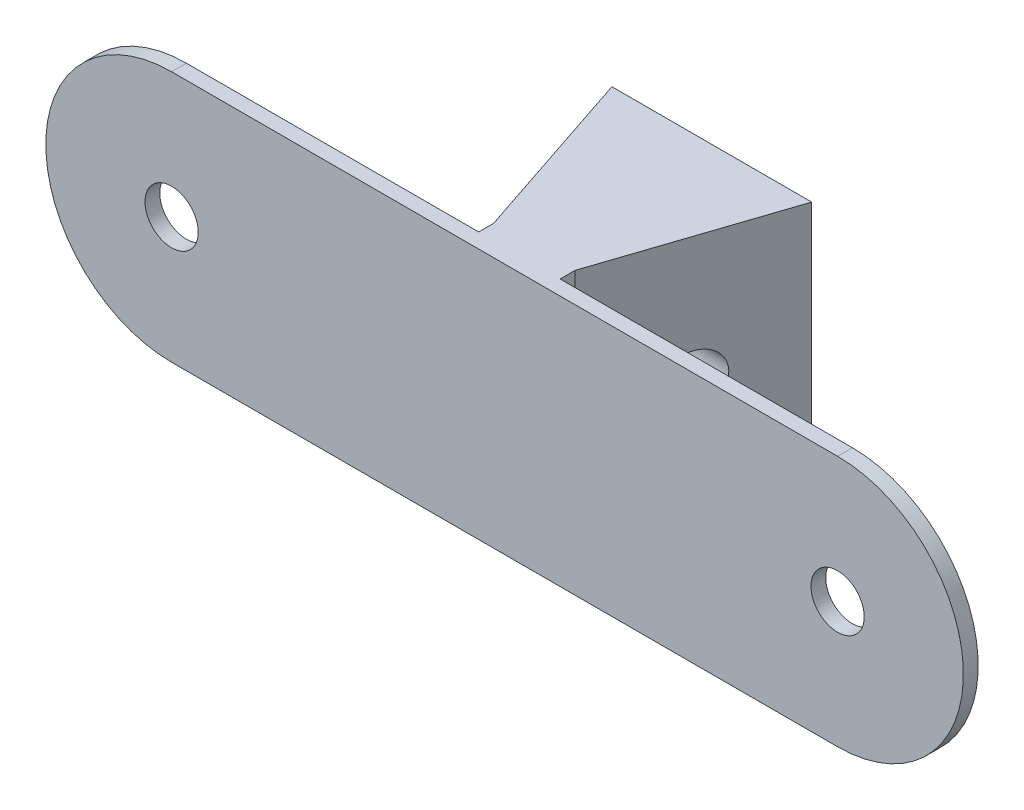
ISO-10303-21;
HEADER;
FILE_DESCRIPTION(('STEP AP214'),'2;1');
FILE_NAME('part.step','',(''),(''),'','','');
FILE_SCHEMA(('AUTOMOTIVE_DESIGN { 1 0 10303 214 1 1 1 1 }'));
ENDSEC;
DATA;
#1=APPLICATION_CONTEXT('core data for automotive mechanical design processes');
#2=APPLICATION_PROTOCOL_DEFINITION('international standard','automotive_design',2000,#1);
#3=PRODUCT_CONTEXT('',#1,'mechanical');
#4=PRODUCT('Part','Part','',(#3));
#5=PRODUCT_RELATED_PRODUCT_CATEGORY('part','',(#4));
#6=PRODUCT_DEFINITION_FORMATION('','',#4);
#7=PRODUCT_DEFINITION_CONTEXT('part definition',#1,'design');
#8=PRODUCT_DEFINITION('design','',#6,#7);
#9=PRODUCT_DEFINITION_SHAPE('','',#8);
#10=(LENGTH_UNIT() NAMED_UNIT(*) SI_UNIT(.MILLI.,.METRE.));
#11=(NAMED_UNIT(*) PLANE_ANGLE_UNIT() SI_UNIT($,.RADIAN.));
#12=(NAMED_UNIT(*) SI_UNIT($,.STERADIAN.) SOLID_ANGLE_UNIT());
#13=UNCERTAINTY_MEASURE_WITH_UNIT(LENGTH_MEASURE(1.E-05),#10,'distance_accuracy_value','');
#14=(GEOMETRIC_REPRESENTATION_CONTEXT(3) GLOBAL_UNCERTAINTY_ASSIGNED_CONTEXT((#13)) GLOBAL_UNIT_ASSIGNED_CONTEXT((#10,
#11,#12)) REPRESENTATION_CONTEXT('',''));
#15=CARTESIAN_POINT('',(0.,0.,0.));
#16=DIRECTION('',(0.,0.,1.));
#17=DIRECTION('',(1.,0.,0.));
#18=AXIS2_PLACEMENT_3D('',#15,#16,#17);
#19=CARTESIAN_POINT('',(0.,0.,0.));
#20=DIRECTION('',(0.,0.,1.));
#21=DIRECTION('',(1.,0.,0.));
#22=AXIS2_PLACEMENT_3D('',#19,#20,#21);
#23=PLANE('',#22);
#24=CARTESIAN_POINT('',(45.,0.,0.));
#25=DIRECTION('',(0.,0.,1.));
#26=DIRECTION('',(1.,0.,0.));
#27=AXIS2_PLACEMENT_3D('',#24,#25,#26);
#28=CIRCLE('',#27,1.8);
#29=CARTESIAN_POINT('',(46.8,0.,0.));
#30=VERTEX_POINT('',#29);
#31=EDGE_CURVE('E209',#30,#30,#28,.T.);
#32=ORIENTED_EDGE('',*,*,#31,.T.);
#33=EDGE_LOOP('',(#32));
#34=FACE_BOUND('',#33,.T.);
#35=CARTESIAN_POINT('',(0.,0.,0.));
#36=DIRECTION('',(0.,0.,1.));
#37=DIRECTION('',(1.,0.,0.));
#38=AXIS2_PLACEMENT_3D('',#35,#36,#37);
#39=CIRCLE('',#38,1.79999999999999);
#40=CARTESIAN_POINT('',(1.79999999999999,0.,0.));
#41=VERTEX_POINT('',#40);
#42=EDGE_CURVE('E201',#41,#41,#39,.T.);
#43=ORIENTED_EDGE('',*,*,#42,.T.);
#44=EDGE_LOOP('',(#43));
#45=FACE_BOUND('',#44,.T.);
#46=DIRECTION('',(0.,1.,0.));
#47=VECTOR('',#46,1.);
#48=CARTESIAN_POINT('',(19.75,-6.99999999999999,0.));
#49=LINE('',#48,#47);
#50=CARTESIAN_POINT('',(19.75,-6.99999999999999,0.));
#51=VERTEX_POINT('',#50);
#52=CARTESIAN_POINT('',(19.75,8.50000000000001,0.));
#53=VERTEX_POINT('',#52);
#54=EDGE_CURVE('E149',#51,#53,#49,.T.);
#55=ORIENTED_EDGE('',*,*,#54,.F.);
#56=DIRECTION('',(1.,0.,0.));
#57=VECTOR('',#56,1.);
#58=CARTESIAN_POINT('',(25.25,-6.99999999999999,0.));
#59=LINE('',#58,#57);
#60=CARTESIAN_POINT('',(25.25,-6.99999999999999,0.));
#61=VERTEX_POINT('',#60);
#62=EDGE_CURVE('E141',#51,#61,#59,.T.);
#63=ORIENTED_EDGE('',*,*,#62,.T.);
#64=DIRECTION('',(0.,1.,0.));
#65=VECTOR('',#64,1.);
#66=CARTESIAN_POINT('',(25.25,-6.99999999999999,0.));
#67=LINE('',#66,#65);
#68=CARTESIAN_POINT('',(25.25,8.50000000000001,0.));
#69=VERTEX_POINT('',#68);
#70=EDGE_CURVE('E125',#61,#69,#67,.T.);
#71=ORIENTED_EDGE('',*,*,#70,.T.);
#72=DIRECTION('',(-1.,0.,0.));
#73=VECTOR('',#72,1.);
#74=CARTESIAN_POINT('',(0.,8.50000000000001,0.));
#75=LINE('',#74,#73);
#76=CARTESIAN_POINT('',(45.,8.50000000000001,0.));
#77=VERTEX_POINT('',#76);
#78=EDGE_CURVE('E217',#77,#69,#75,.T.);
#79=ORIENTED_EDGE('',*,*,#78,.F.);
#80=CARTESIAN_POINT('',(44.9999999999999,0.,0.));
#81=DIRECTION('',(0.,0.,1.));
#82=DIRECTION('',(1.,0.,0.));
#83=AXIS2_PLACEMENT_3D('',#80,#81,#82);
#84=CIRCLE('',#83,8.50000000000001);
#85=CARTESIAN_POINT('',(45.,-8.50000000000001,0.));
#86=VERTEX_POINT('',#85);
#87=EDGE_CURVE('E232',#86,#77,#84,.T.);
#88=ORIENTED_EDGE('',*,*,#87,.F.);
#89=DIRECTION('',(1.,0.,0.));
#90=VECTOR('',#89,1.);
#91=CARTESIAN_POINT('',(0.,-8.50000000000001,0.));
#92=LINE('',#91,#90);
#93=CARTESIAN_POINT('',(0.,-8.50000000000001,0.));
#94=VERTEX_POINT('',#93);
#95=EDGE_CURVE('E229',#94,#86,#92,.T.);
#96=ORIENTED_EDGE('',*,*,#95,.F.);
#97=CARTESIAN_POINT('',(0.,0.,0.));
#98=DIRECTION('',(0.,0.,1.));
#99=DIRECTION('',(1.,0.,0.));
#100=AXIS2_PLACEMENT_3D('',#97,#98,#99);
#101=CIRCLE('',#100,8.50000000000001);
#102=CARTESIAN_POINT('',(0.,8.50000000000001,0.));
#103=VERTEX_POINT('',#102);
#104=EDGE_CURVE('E213',#103,#94,#101,.T.);
#105=ORIENTED_EDGE('',*,*,#104,.F.);
#106=EDGE_CURVE('E86',#53,#103,#75,.T.);
#107=ORIENTED_EDGE('',*,*,#106,.F.);
#108=EDGE_LOOP('',(#55,#63,#71,#79,#88,#96,#105,#107));
#109=FACE_BOUND('',#108,.T.);
#110=ADVANCED_FACE('F39',(#34,#45,#109),#23,.F.);
#111=CARTESIAN_POINT('',(0.,0.,1.));
#112=DIRECTION('',(0.,0.,-1.));
#113=DIRECTION('',(-1.,0.,0.));
#114=AXIS2_PLACEMENT_3D('',#111,#112,#113);
#115=CYLINDRICAL_SURFACE('',#114,8.50000000000001);
#116=ORIENTED_EDGE('',*,*,#104,.T.);
#117=DIRECTION('',(0.,0.,-1.));
#118=VECTOR('',#117,1.);
#119=CARTESIAN_POINT('',(0.,-8.50000000000001,1.));
#120=LINE('',#119,#118);
#121=CARTESIAN_POINT('',(0.,-8.50000000000001,1.));
#122=VERTEX_POINT('',#121);
#123=EDGE_CURVE('E11',#122,#94,#120,.T.);
#124=ORIENTED_EDGE('',*,*,#123,.F.);
#125=CARTESIAN_POINT('',(0.,0.,1.));
#126=DIRECTION('',(0.,0.,1.));
#127=DIRECTION('',(1.,0.,0.));
#128=AXIS2_PLACEMENT_3D('',#125,#126,#127);
#129=CIRCLE('',#128,8.50000000000001);
#130=CARTESIAN_POINT('',(0.,8.50000000000001,1.));
#131=VERTEX_POINT('',#130);
#132=EDGE_CURVE('E214',#131,#122,#129,.T.);
#133=ORIENTED_EDGE('',*,*,#132,.F.);
#134=DIRECTION('',(0.,0.,-1.));
#135=VECTOR('',#134,1.);
#136=CARTESIAN_POINT('',(0.,8.50000000000001,1.));
#137=LINE('',#136,#135);
#138=EDGE_CURVE('E225',#131,#103,#137,.T.);
#139=ORIENTED_EDGE('',*,*,#138,.T.);
#140=EDGE_LOOP('',(#116,#124,#133,#139));
#141=FACE_BOUND('',#140,.T.);
#142=ADVANCED_FACE('F41',(#141),#115,.T.);
#143=CARTESIAN_POINT('',(0.,-8.50000000000001,1.));
#144=DIRECTION('',(0.,1.,0.));
#145=DIRECTION('',(0.,0.,1.));
#146=AXIS2_PLACEMENT_3D('',#143,#144,#145);
#147=PLANE('',#146);
#148=ORIENTED_EDGE('',*,*,#95,.T.);
#149=DIRECTION('',(0.,0.,-1.));
#150=VECTOR('',#149,1.);
#151=CARTESIAN_POINT('',(45.,-8.50000000000001,1.));
#152=LINE('',#151,#150);
#153=CARTESIAN_POINT('',(45.,-8.50000000000001,1.));
#154=VERTEX_POINT('',#153);
#155=EDGE_CURVE('E49',#154,#86,#152,.T.);
#156=ORIENTED_EDGE('',*,*,#155,.F.);
#157=DIRECTION('',(1.,0.,0.));
#158=VECTOR('',#157,1.);
#159=CARTESIAN_POINT('',(0.,-8.50000000000001,1.));
#160=LINE('',#159,#158);
#161=EDGE_CURVE('E93',#122,#154,#160,.T.);
#162=ORIENTED_EDGE('',*,*,#161,.F.);
#163=ORIENTED_EDGE('',*,*,#123,.T.);
#164=EDGE_LOOP('',(#148,#156,#162,#163));
#165=FACE_BOUND('',#164,.T.);
#166=ADVANCED_FACE('F276',(#165),#147,.F.);
#167=CARTESIAN_POINT('',(44.9999999999999,0.,1.));
#168=DIRECTION('',(0.,0.,-1.));
#169=DIRECTION('',(-1.,0.,0.));
#170=AXIS2_PLACEMENT_3D('',#167,#168,#169);
#171=CYLINDRICAL_SURFACE('',#170,8.50000000000001);
#172=ORIENTED_EDGE('',*,*,#87,.T.);
#173=DIRECTION('',(0.,0.,-1.));
#174=VECTOR('',#173,1.);
#175=CARTESIAN_POINT('',(45.,8.50000000000001,1.));
#176=LINE('',#175,#174);
#177=CARTESIAN_POINT('',(45.,8.50000000000001,1.));
#178=VERTEX_POINT('',#177);
#179=EDGE_CURVE('E239',#178,#77,#176,.T.);
#180=ORIENTED_EDGE('',*,*,#179,.F.);
#181=CARTESIAN_POINT('',(44.9999999999999,0.,1.));
#182=DIRECTION('',(0.,0.,1.));
#183=DIRECTION('',(1.,0.,0.));
#184=AXIS2_PLACEMENT_3D('',#181,#182,#183);
#185=CIRCLE('',#184,8.50000000000001);
#186=EDGE_CURVE('E220',#154,#178,#185,.T.);
#187=ORIENTED_EDGE('',*,*,#186,.F.);
#188=ORIENTED_EDGE('',*,*,#155,.T.);
#189=EDGE_LOOP('',(#172,#180,#187,#188));
#190=FACE_BOUND('',#189,.T.);
#191=ADVANCED_FACE('F248',(#190),#171,.T.);
#192=CARTESIAN_POINT('',(0.,8.50000000000001,1.));
#193=DIRECTION('',(0.,-1.,0.));
#194=DIRECTION('',(0.,0.,-1.));
#195=AXIS2_PLACEMENT_3D('',#192,#193,#194);
#196=PLANE('',#195);
#197=ORIENTED_EDGE('',*,*,#78,.T.);
#198=DIRECTION('',(0.,0.,-1.));
#199=VECTOR('',#198,1.);
#200=CARTESIAN_POINT('',(25.25,8.50000000000001,-0.999999999999997));
#201=LINE('',#200,#199);
#202=CARTESIAN_POINT('',(25.25,8.50000000000001,-0.999999999999997));
#203=VERTEX_POINT('',#202);
#204=EDGE_CURVE('E56',#69,#203,#201,.T.);
#205=ORIENTED_EDGE('',*,*,#204,.T.);
#206=DIRECTION('',(0.316227766016838,0.,-0.948683298050514));
#207=VECTOR('',#206,1.);
#208=CARTESIAN_POINT('',(29.25,8.50000000000001,-13.));
#209=LINE('',#208,#207);
#210=CARTESIAN_POINT('',(29.25,8.50000000000001,-13.));
#211=VERTEX_POINT('',#210);
#212=EDGE_CURVE('E173',#203,#211,#209,.T.);
#213=ORIENTED_EDGE('',*,*,#212,.T.);
#214=DIRECTION('',(-1.,0.,0.));
#215=VECTOR('',#214,1.);
#216=CARTESIAN_POINT('',(15.75,8.50000000000001,-13.));
#217=LINE('',#216,#215);
#218=CARTESIAN_POINT('',(15.75,8.50000000000001,-13.));
#219=VERTEX_POINT('',#218);
#220=EDGE_CURVE('E177',#211,#219,#217,.T.);
#221=ORIENTED_EDGE('',*,*,#220,.T.);
#222=DIRECTION('',(0.316227766016838,0.,0.948683298050514));
#223=VECTOR('',#222,1.);
#224=CARTESIAN_POINT('',(19.75,8.50000000000001,-1.));
#225=LINE('',#224,#223);
#226=CARTESIAN_POINT('',(19.75,8.50000000000001,-1.));
#227=VERTEX_POINT('',#226);
#228=EDGE_CURVE('E154',#219,#227,#225,.T.);
#229=ORIENTED_EDGE('',*,*,#228,.T.);
#230=DIRECTION('',(0.,0.,1.));
#231=VECTOR('',#230,1.);
#232=CARTESIAN_POINT('',(19.75,8.50000000000001,0.));
#233=LINE('',#232,#231);
#234=EDGE_CURVE('E151',#227,#53,#233,.T.);
#235=ORIENTED_EDGE('',*,*,#234,.T.);
#236=ORIENTED_EDGE('',*,*,#106,.T.);
#237=ORIENTED_EDGE('',*,*,#138,.F.);
#238=DIRECTION('',(-1.,0.,0.));
#239=VECTOR('',#238,1.);
#240=CARTESIAN_POINT('',(0.,8.50000000000001,1.));
#241=LINE('',#240,#239);
#242=EDGE_CURVE('E65',#178,#131,#241,.T.);
#243=ORIENTED_EDGE('',*,*,#242,.F.);
#244=ORIENTED_EDGE('',*,*,#179,.T.);
#245=EDGE_LOOP('',(#197,#205,#213,#221,#229,#235,#236,#237,#243,#244));
#246=FACE_BOUND('',#245,.T.);
#247=ADVANCED_FACE('F251',(#246),#196,.F.);
#248=CARTESIAN_POINT('',(0.,0.,1.));
#249=DIRECTION('',(0.,0.,1.));
#250=DIRECTION('',(1.,0.,0.));
#251=AXIS2_PLACEMENT_3D('',#248,#249,#250);
#252=PLANE('',#251);
#253=CARTESIAN_POINT('',(0.,0.,1.));
#254=DIRECTION('',(0.,0.,1.));
#255=DIRECTION('',(1.,0.,0.));
#256=AXIS2_PLACEMENT_3D('',#253,#254,#255);
#257=CIRCLE('',#256,1.79999999999999);
#258=CARTESIAN_POINT('',(1.79999999999999,0.,1.));
#259=VERTEX_POINT('',#258);
#260=EDGE_CURVE('E186',#259,#259,#257,.T.);
#261=ORIENTED_EDGE('',*,*,#260,.F.);
#262=EDGE_LOOP('',(#261));
#263=FACE_BOUND('',#262,.T.);
#264=CARTESIAN_POINT('',(45.,0.,1.));
#265=DIRECTION('',(0.,0.,1.));
#266=DIRECTION('',(1.,0.,0.));
#267=AXIS2_PLACEMENT_3D('',#264,#265,#266);
#268=CIRCLE('',#267,1.79999999999999);
#269=CARTESIAN_POINT('',(46.8,0.,1.));
#270=VERTEX_POINT('',#269);
#271=EDGE_CURVE('E205',#270,#270,#268,.T.);
#272=ORIENTED_EDGE('',*,*,#271,.F.);
#273=EDGE_LOOP('',(#272));
#274=FACE_BOUND('',#273,.T.);
#275=ORIENTED_EDGE('',*,*,#132,.T.);
#276=ORIENTED_EDGE('',*,*,#161,.T.);
#277=ORIENTED_EDGE('',*,*,#186,.T.);
#278=ORIENTED_EDGE('',*,*,#242,.T.);
#279=EDGE_LOOP('',(#275,#276,#277,#278));
#280=FACE_BOUND('',#279,.T.);
#281=ADVANCED_FACE('F255',(#263,#274,#280),#252,.T.);
#282=CARTESIAN_POINT('',(45.,0.,1.));
#283=DIRECTION('',(0.,0.,1.));
#284=DIRECTION('',(1.,0.,0.));
#285=AXIS2_PLACEMENT_3D('',#282,#283,#284);
#286=CYLINDRICAL_SURFACE('',#285,1.8);
#287=ORIENTED_EDGE('',*,*,#31,.F.);
#288=EDGE_LOOP('',(#287));
#289=FACE_BOUND('',#288,.T.);
#290=ORIENTED_EDGE('',*,*,#271,.T.);
#291=EDGE_LOOP('',(#290));
#292=FACE_BOUND('',#291,.T.);
#293=ADVANCED_FACE('F257',(#289,#292),#286,.F.);
#294=CARTESIAN_POINT('',(0.,0.,1.));
#295=DIRECTION('',(0.,0.,1.));
#296=DIRECTION('',(1.,0.,0.));
#297=AXIS2_PLACEMENT_3D('',#294,#295,#296);
#298=CYLINDRICAL_SURFACE('',#297,1.79999999999999);
#299=ORIENTED_EDGE('',*,*,#42,.F.);
#300=EDGE_LOOP('',(#299));
#301=FACE_BOUND('',#300,.T.);
#302=ORIENTED_EDGE('',*,*,#260,.T.);
#303=EDGE_LOOP('',(#302));
#304=FACE_BOUND('',#303,.T.);
#305=ADVANCED_FACE('F264',(#301,#304),#298,.F.);
#306=CARTESIAN_POINT('',(19.75,-6.99999999999999,0.));
#307=DIRECTION('',(-1.,0.,0.));
#308=DIRECTION('',(0.,0.,1.));
#309=AXIS2_PLACEMENT_3D('',#306,#307,#308);
#310=PLANE('',#309);
#311=ORIENTED_EDGE('',*,*,#234,.F.);
#312=DIRECTION('',(0.,1.,0.));
#313=VECTOR('',#312,1.);
#314=CARTESIAN_POINT('',(19.75,-6.99999999999999,-1.));
#315=LINE('',#314,#313);
#316=CARTESIAN_POINT('',(19.75,-6.99999999999999,-1.));
#317=VERTEX_POINT('',#316);
#318=EDGE_CURVE('E187',#317,#227,#315,.T.);
#319=ORIENTED_EDGE('',*,*,#318,.F.);
#320=DIRECTION('',(0.,0.,1.));
#321=VECTOR('',#320,1.);
#322=CARTESIAN_POINT('',(19.75,-6.99999999999999,0.));
#323=LINE('',#322,#321);
#324=EDGE_CURVE('E135',#317,#51,#323,.T.);
#325=ORIENTED_EDGE('',*,*,#324,.T.);
#326=ORIENTED_EDGE('',*,*,#54,.T.);
#327=EDGE_LOOP('',(#311,#319,#325,#326));
#328=FACE_BOUND('',#327,.T.);
#329=ADVANCED_FACE('F304',(#328),#310,.T.);
#330=CARTESIAN_POINT('',(19.75,-6.99999999999999,-1.));
#331=DIRECTION('',(-0.948683298050514,0.,0.316227766016838));
#332=DIRECTION('',(0.316227766016838,0.,0.948683298050514));
#333=AXIS2_PLACEMENT_3D('',#330,#331,#332);
#334=PLANE('',#333);
#335=CARTESIAN_POINT('',(17.75,0.,-7.));
#336=DIRECTION('',(-0.948683298050514,0.,0.316227766016838));
#337=DIRECTION('',(-0.316227766016838,0.,-0.948683298050514));
#338=AXIS2_PLACEMENT_3D('',#335,#336,#337);
#339=ELLIPSE('',#338,1.89736659610102,1.79999999999999);
#340=CARTESIAN_POINT('',(17.15,0.,-8.79999999999999));
#341=VERTEX_POINT('',#340);
#342=EDGE_CURVE('E157',#341,#341,#339,.T.);
#343=ORIENTED_EDGE('',*,*,#342,.F.);
#344=EDGE_LOOP('',(#343));
#345=FACE_BOUND('',#344,.T.);
#346=ORIENTED_EDGE('',*,*,#228,.F.);
#347=DIRECTION('',(0.,1.,0.));
#348=VECTOR('',#347,1.);
#349=CARTESIAN_POINT('',(15.75,-6.99999999999999,-13.));
#350=LINE('',#349,#348);
#351=CARTESIAN_POINT('',(15.75,-6.99999999999999,-13.));
#352=VERTEX_POINT('',#351);
#353=EDGE_CURVE('E190',#352,#219,#350,.T.);
#354=ORIENTED_EDGE('',*,*,#353,.F.);
#355=DIRECTION('',(0.316227766016838,0.,0.948683298050514));
#356=VECTOR('',#355,1.);
#357=CARTESIAN_POINT('',(19.75,-6.99999999999999,-1.));
#358=LINE('',#357,#356);
#359=EDGE_CURVE('E165',#352,#317,#358,.T.);
#360=ORIENTED_EDGE('',*,*,#359,.T.);
#361=ORIENTED_EDGE('',*,*,#318,.T.);
#362=EDGE_LOOP('',(#346,#354,#360,#361));
#363=FACE_BOUND('',#362,.T.);
#364=ADVANCED_FACE('F308',(#345,#363),#334,.T.);
#365=CARTESIAN_POINT('',(15.75,-6.99999999999999,-13.));
#366=DIRECTION('',(0.,0.,-1.));
#367=DIRECTION('',(-1.,0.,0.));
#368=AXIS2_PLACEMENT_3D('',#365,#366,#367);
#369=PLANE('',#368);
#370=ORIENTED_EDGE('',*,*,#220,.F.);
#371=DIRECTION('',(0.,1.,0.));
#372=VECTOR('',#371,1.);
#373=CARTESIAN_POINT('',(29.25,-6.99999999999999,-13.));
#374=LINE('',#373,#372);
#375=CARTESIAN_POINT('',(29.25,-6.99999999999999,-13.));
#376=VERTEX_POINT('',#375);
#377=EDGE_CURVE('E193',#376,#211,#374,.T.);
#378=ORIENTED_EDGE('',*,*,#377,.F.);
#379=DIRECTION('',(-1.,0.,0.));
#380=VECTOR('',#379,1.);
#381=CARTESIAN_POINT('',(15.75,-6.99999999999999,-13.));
#382=LINE('',#381,#380);
#383=EDGE_CURVE('E161',#376,#352,#382,.T.);
#384=ORIENTED_EDGE('',*,*,#383,.T.);
#385=ORIENTED_EDGE('',*,*,#353,.T.);
#386=EDGE_LOOP('',(#370,#378,#384,#385));
#387=FACE_BOUND('',#386,.T.);
#388=ADVANCED_FACE('F317',(#387),#369,.T.);
#389=CARTESIAN_POINT('',(29.25,-6.99999999999999,-13.));
#390=DIRECTION('',(0.948683298050514,0.,0.316227766016838));
#391=DIRECTION('',(0.316227766016838,0.,-0.948683298050514));
#392=AXIS2_PLACEMENT_3D('',#389,#390,#391);
#393=PLANE('',#392);
#394=CARTESIAN_POINT('',(27.25,0.,-7.));
#395=DIRECTION('',(0.948683298050514,0.,0.316227766016838));
#396=DIRECTION('',(-0.316227766016838,0.,0.948683298050514));
#397=AXIS2_PLACEMENT_3D('',#394,#395,#396);
#398=ELLIPSE('',#397,1.89736659610102,1.79999999999999);
#399=CARTESIAN_POINT('',(26.65,0.,-5.20000000000001));
#400=VERTEX_POINT('',#399);
#401=EDGE_CURVE('E43',#400,#400,#398,.T.);
#402=ORIENTED_EDGE('',*,*,#401,.F.);
#403=EDGE_LOOP('',(#402));
#404=FACE_BOUND('',#403,.T.);
#405=ORIENTED_EDGE('',*,*,#212,.F.);
#406=DIRECTION('',(0.,1.,0.));
#407=VECTOR('',#406,1.);
#408=CARTESIAN_POINT('',(25.25,-6.99999999999999,-0.999999999999997));
#409=LINE('',#408,#407);
#410=CARTESIAN_POINT('',(25.25,-6.99999999999999,-0.999999999999997));
#411=VERTEX_POINT('',#410);
#412=EDGE_CURVE('E134',#411,#203,#409,.T.);
#413=ORIENTED_EDGE('',*,*,#412,.F.);
#414=DIRECTION('',(0.316227766016838,0.,-0.948683298050514));
#415=VECTOR('',#414,1.);
#416=CARTESIAN_POINT('',(29.25,-6.99999999999999,-13.));
#417=LINE('',#416,#415);
#418=EDGE_CURVE('E145',#411,#376,#417,.T.);
#419=ORIENTED_EDGE('',*,*,#418,.T.);
#420=ORIENTED_EDGE('',*,*,#377,.T.);
#421=EDGE_LOOP('',(#405,#413,#419,#420));
#422=FACE_BOUND('',#421,.T.);
#423=ADVANCED_FACE('F322',(#404,#422),#393,.T.);
#424=CARTESIAN_POINT('',(25.25,-6.99999999999999,-0.999999999999997));
#425=DIRECTION('',(1.,0.,0.));
#426=DIRECTION('',(0.,0.,-1.));
#427=AXIS2_PLACEMENT_3D('',#424,#425,#426);
#428=PLANE('',#427);
#429=ORIENTED_EDGE('',*,*,#204,.F.);
#430=ORIENTED_EDGE('',*,*,#70,.F.);
#431=DIRECTION('',(0.,0.,-1.));
#432=VECTOR('',#431,1.);
#433=CARTESIAN_POINT('',(25.25,-6.99999999999999,-0.999999999999997));
#434=LINE('',#433,#432);
#435=EDGE_CURVE('E128',#61,#411,#434,.T.);
#436=ORIENTED_EDGE('',*,*,#435,.T.);
#437=ORIENTED_EDGE('',*,*,#412,.T.);
#438=EDGE_LOOP('',(#429,#430,#436,#437));
#439=FACE_BOUND('',#438,.T.);
#440=ADVANCED_FACE('F127',(#439),#428,.T.);
#441=CARTESIAN_POINT('',(0.,-6.99999999999999,0.));
#442=DIRECTION('',(0.,-1.,0.));
#443=DIRECTION('',(0.,0.,-1.));
#444=AXIS2_PLACEMENT_3D('',#441,#442,#443);
#445=PLANE('',#444);
#446=ORIENTED_EDGE('',*,*,#62,.F.);
#447=ORIENTED_EDGE('',*,*,#324,.F.);
#448=ORIENTED_EDGE('',*,*,#359,.F.);
#449=ORIENTED_EDGE('',*,*,#383,.F.);
#450=ORIENTED_EDGE('',*,*,#418,.F.);
#451=ORIENTED_EDGE('',*,*,#435,.F.);
#452=EDGE_LOOP('',(#446,#447,#448,#449,#450,#451));
#453=FACE_BOUND('',#452,.T.);
#454=ADVANCED_FACE('F139',(#453),#445,.T.);
#455=CARTESIAN_POINT('',(0.,0.,-7.));
#456=DIRECTION('',(-1.,0.,0.));
#457=DIRECTION('',(0.,0.,1.));
#458=AXIS2_PLACEMENT_3D('',#455,#456,#457);
#459=CYLINDRICAL_SURFACE('',#458,1.79999999999999);
#460=ORIENTED_EDGE('',*,*,#342,.T.);
#461=EDGE_LOOP('',(#460));
#462=FACE_BOUND('',#461,.T.);
#463=ORIENTED_EDGE('',*,*,#401,.T.);
#464=EDGE_LOOP('',(#463));
#465=FACE_BOUND('',#464,.T.);
#466=ADVANCED_FACE('F342',(#462,#465),#459,.F.);
#467=CLOSED_SHELL('',(#110,#142,#166,#191,#247,#281,#293,#305,#329,#364,#388,#423,#440,#454,#466));
#468=MANIFOLD_SOLID_BREP('B2',#467);
#469=ADVANCED_BREP_SHAPE_REPRESENTATION('',(#18,#468),#14);
#470=SHAPE_DEFINITION_REPRESENTATION(#9,#469);
ENDSEC;
END-ISO-10303-21;
